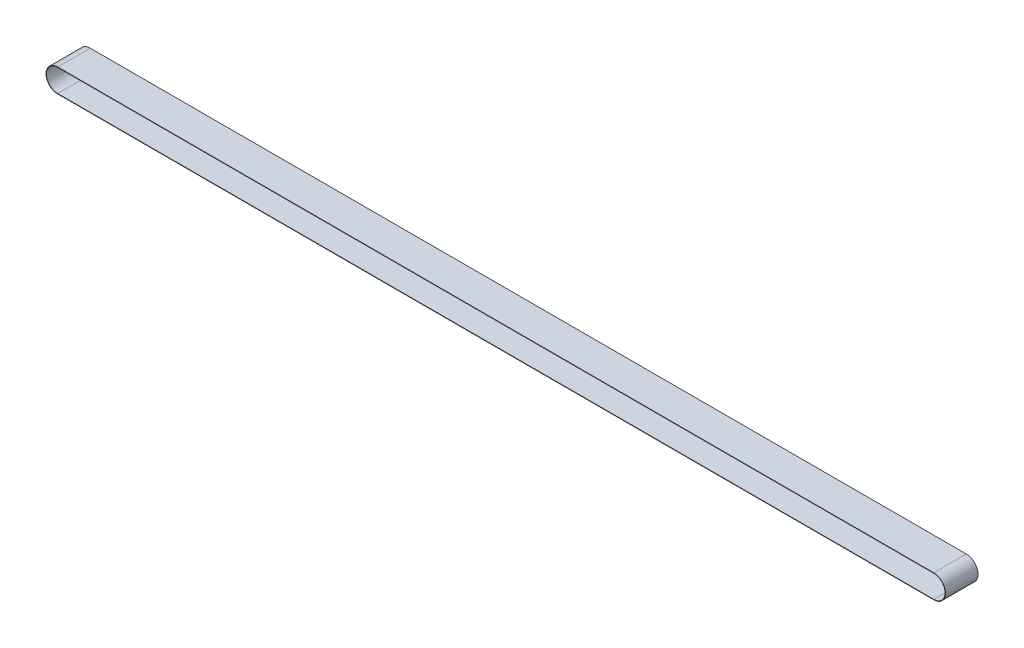
ISO-10303-21;
HEADER;
FILE_DESCRIPTION(('STEP AP214'),'2;1');
FILE_NAME('part.step','',(''),(''),'','','');
FILE_SCHEMA(('AUTOMOTIVE_DESIGN { 1 0 10303 214 1 1 1 1 }'));
ENDSEC;
DATA;
#1=APPLICATION_CONTEXT('core data for automotive mechanical design processes');
#2=APPLICATION_PROTOCOL_DEFINITION('international standard','automotive_design',2000,#1);
#3=PRODUCT_CONTEXT('',#1,'mechanical');
#4=PRODUCT('Part','Part','',(#3));
#5=PRODUCT_RELATED_PRODUCT_CATEGORY('part','',(#4));
#6=PRODUCT_DEFINITION_FORMATION('','',#4);
#7=PRODUCT_DEFINITION_CONTEXT('part definition',#1,'design');
#8=PRODUCT_DEFINITION('design','',#6,#7);
#9=PRODUCT_DEFINITION_SHAPE('','',#8);
#10=(LENGTH_UNIT() NAMED_UNIT(*) SI_UNIT(.MILLI.,.METRE.));
#11=(NAMED_UNIT(*) PLANE_ANGLE_UNIT() SI_UNIT($,.RADIAN.));
#12=(NAMED_UNIT(*) SI_UNIT($,.STERADIAN.) SOLID_ANGLE_UNIT());
#13=UNCERTAINTY_MEASURE_WITH_UNIT(LENGTH_MEASURE(1.E-05),#10,'distance_accuracy_value','');
#14=(GEOMETRIC_REPRESENTATION_CONTEXT(3) GLOBAL_UNCERTAINTY_ASSIGNED_CONTEXT((#13)) GLOBAL_UNIT_ASSIGNED_CONTEXT((#10,
#11,#12)) REPRESENTATION_CONTEXT('',''));
#15=CARTESIAN_POINT('',(0.,0.,0.));
#16=DIRECTION('',(0.,0.,1.));
#17=DIRECTION('',(1.,0.,0.));
#18=AXIS2_PLACEMENT_3D('',#15,#16,#17);
#19=CARTESIAN_POINT('',(-1010.,0.,37.5));
#20=DIRECTION('',(0.,0.,1.));
#21=DIRECTION('',(1.,0.,0.));
#22=AXIS2_PLACEMENT_3D('',#19,#20,#21);
#23=PLANE('',#22);
#24=CARTESIAN_POINT('',(-1010.,0.,37.5));
#25=DIRECTION('',(0.,0.,1.));
#26=DIRECTION('',(1.,0.,0.));
#27=AXIS2_PLACEMENT_3D('',#24,#25,#26);
#28=CIRCLE('',#27,27.0000000000004);
#29=CARTESIAN_POINT('',(-1010.,27.0000000000004,37.5));
#30=VERTEX_POINT('',#29);
#31=CARTESIAN_POINT('',(-1010.,-27.0000000000004,37.5));
#32=VERTEX_POINT('',#31);
#33=EDGE_CURVE('E159',#30,#32,#28,.T.);
#34=ORIENTED_EDGE('',*,*,#33,.T.);
#35=DIRECTION('',(1.,0.,0.));
#36=VECTOR('',#35,1.);
#37=CARTESIAN_POINT('',(-1010.,-27.0000000000004,37.5));
#38=LINE('',#37,#36);
#39=CARTESIAN_POINT('',(1010.,-27.,37.5));
#40=VERTEX_POINT('',#39);
#41=EDGE_CURVE('E162',#32,#40,#38,.T.);
#42=ORIENTED_EDGE('',*,*,#41,.T.);
#43=CARTESIAN_POINT('',(1010.,0.,37.5));
#44=DIRECTION('',(0.,0.,1.));
#45=DIRECTION('',(1.,0.,0.));
#46=AXIS2_PLACEMENT_3D('',#43,#44,#45);
#47=CIRCLE('',#46,27.0000000000004);
#48=CARTESIAN_POINT('',(1010.,27.0000000000004,37.5));
#49=VERTEX_POINT('',#48);
#50=EDGE_CURVE('E165',#40,#49,#47,.T.);
#51=ORIENTED_EDGE('',*,*,#50,.T.);
#52=DIRECTION('',(-1.,0.,0.));
#53=VECTOR('',#52,1.);
#54=CARTESIAN_POINT('',(-1010.,27.0000000000004,37.5));
#55=LINE('',#54,#53);
#56=EDGE_CURVE('E167',#49,#30,#55,.T.);
#57=ORIENTED_EDGE('',*,*,#56,.T.);
#58=EDGE_LOOP('',(#34,#42,#51,#57));
#59=FACE_BOUND('',#58,.T.);
#60=DIRECTION('',(1.,0.,0.));
#61=VECTOR('',#60,1.);
#62=CARTESIAN_POINT('',(-1010.,-26.0000000000004,37.5));
#63=LINE('',#62,#61);
#64=CARTESIAN_POINT('',(-1010.,-26.0000000000004,37.5));
#65=VERTEX_POINT('',#64);
#66=CARTESIAN_POINT('',(1010.,-26.0000000000004,37.5));
#67=VERTEX_POINT('',#66);
#68=EDGE_CURVE('E131',#65,#67,#63,.T.);
#69=ORIENTED_EDGE('',*,*,#68,.F.);
#70=CARTESIAN_POINT('',(-1010.,0.,37.5));
#71=DIRECTION('',(0.,0.,1.));
#72=DIRECTION('',(1.,0.,0.));
#73=AXIS2_PLACEMENT_3D('',#70,#71,#72);
#74=CIRCLE('',#73,26.0000000000004);
#75=CARTESIAN_POINT('',(-1010.,26.0000000000004,37.5));
#76=VERTEX_POINT('',#75);
#77=EDGE_CURVE('E123',#76,#65,#74,.T.);
#78=ORIENTED_EDGE('',*,*,#77,.F.);
#79=DIRECTION('',(-1.,0.,0.));
#80=VECTOR('',#79,1.);
#81=CARTESIAN_POINT('',(-1010.,26.0000000000004,37.5));
#82=LINE('',#81,#80);
#83=CARTESIAN_POINT('',(1010.,26.0000000000007,37.5));
#84=VERTEX_POINT('',#83);
#85=EDGE_CURVE('E145',#84,#76,#82,.T.);
#86=ORIENTED_EDGE('',*,*,#85,.F.);
#87=CARTESIAN_POINT('',(1010.,0.,37.5));
#88=DIRECTION('',(0.,0.,1.));
#89=DIRECTION('',(1.,0.,0.));
#90=AXIS2_PLACEMENT_3D('',#87,#88,#89);
#91=CIRCLE('',#90,26.0000000000004);
#92=EDGE_CURVE('E143',#67,#84,#91,.T.);
#93=ORIENTED_EDGE('',*,*,#92,.F.);
#94=EDGE_LOOP('',(#69,#78,#86,#93));
#95=FACE_BOUND('',#94,.T.);
#96=ADVANCED_FACE('F58',(#59,#95),#23,.T.);
#97=CARTESIAN_POINT('',(-1010.,0.,-37.5));
#98=DIRECTION('',(0.,0.,1.));
#99=DIRECTION('',(1.,0.,0.));
#100=AXIS2_PLACEMENT_3D('',#97,#98,#99);
#101=PLANE('',#100);
#102=CARTESIAN_POINT('',(-1010.,0.,-37.5));
#103=DIRECTION('',(0.,0.,1.));
#104=DIRECTION('',(1.,0.,0.));
#105=AXIS2_PLACEMENT_3D('',#102,#103,#104);
#106=CIRCLE('',#105,27.0000000000004);
#107=CARTESIAN_POINT('',(-1010.,27.0000000000004,-37.5));
#108=VERTEX_POINT('',#107);
#109=CARTESIAN_POINT('',(-1010.,-27.0000000000004,-37.5));
#110=VERTEX_POINT('',#109);
#111=EDGE_CURVE('E139',#108,#110,#106,.T.);
#112=ORIENTED_EDGE('',*,*,#111,.F.);
#113=DIRECTION('',(-1.,0.,0.));
#114=VECTOR('',#113,1.);
#115=CARTESIAN_POINT('',(-1010.,27.0000000000004,-37.5));
#116=LINE('',#115,#114);
#117=CARTESIAN_POINT('',(1010.,27.0000000000004,-37.5));
#118=VERTEX_POINT('',#117);
#119=EDGE_CURVE('E163',#118,#108,#116,.T.);
#120=ORIENTED_EDGE('',*,*,#119,.F.);
#121=CARTESIAN_POINT('',(1010.,0.,-37.5));
#122=DIRECTION('',(0.,0.,1.));
#123=DIRECTION('',(1.,0.,0.));
#124=AXIS2_PLACEMENT_3D('',#121,#122,#123);
#125=CIRCLE('',#124,27.0000000000004);
#126=CARTESIAN_POINT('',(1010.,-27.,-37.5));
#127=VERTEX_POINT('',#126);
#128=EDGE_CURVE('E174',#127,#118,#125,.T.);
#129=ORIENTED_EDGE('',*,*,#128,.F.);
#130=DIRECTION('',(1.,0.,0.));
#131=VECTOR('',#130,1.);
#132=CARTESIAN_POINT('',(-1010.,-27.0000000000004,-37.5));
#133=LINE('',#132,#131);
#134=EDGE_CURVE('E172',#110,#127,#133,.T.);
#135=ORIENTED_EDGE('',*,*,#134,.F.);
#136=EDGE_LOOP('',(#112,#120,#129,#135));
#137=FACE_BOUND('',#136,.T.);
#138=CARTESIAN_POINT('',(-1010.,0.,-37.5));
#139=DIRECTION('',(0.,0.,1.));
#140=DIRECTION('',(1.,0.,0.));
#141=AXIS2_PLACEMENT_3D('',#138,#139,#140);
#142=CIRCLE('',#141,26.0000000000004);
#143=CARTESIAN_POINT('',(-1010.,26.0000000000004,-37.5));
#144=VERTEX_POINT('',#143);
#145=CARTESIAN_POINT('',(-1010.,-26.0000000000004,-37.5));
#146=VERTEX_POINT('',#145);
#147=EDGE_CURVE('E81',#144,#146,#142,.T.);
#148=ORIENTED_EDGE('',*,*,#147,.T.);
#149=DIRECTION('',(1.,0.,0.));
#150=VECTOR('',#149,1.);
#151=CARTESIAN_POINT('',(-1010.,-26.0000000000004,-37.5));
#152=LINE('',#151,#150);
#153=CARTESIAN_POINT('',(1010.,-26.0000000000004,-37.5));
#154=VERTEX_POINT('',#153);
#155=EDGE_CURVE('E138',#146,#154,#152,.T.);
#156=ORIENTED_EDGE('',*,*,#155,.T.);
#157=CARTESIAN_POINT('',(1010.,0.,-37.5));
#158=DIRECTION('',(0.,0.,1.));
#159=DIRECTION('',(1.,0.,0.));
#160=AXIS2_PLACEMENT_3D('',#157,#158,#159);
#161=CIRCLE('',#160,26.0000000000004);
#162=CARTESIAN_POINT('',(1010.,26.0000000000007,-37.5));
#163=VERTEX_POINT('',#162);
#164=EDGE_CURVE('E151',#154,#163,#161,.T.);
#165=ORIENTED_EDGE('',*,*,#164,.T.);
#166=DIRECTION('',(-1.,0.,0.));
#167=VECTOR('',#166,1.);
#168=CARTESIAN_POINT('',(-1010.,26.0000000000004,-37.5));
#169=LINE('',#168,#167);
#170=EDGE_CURVE('E132',#163,#144,#169,.T.);
#171=ORIENTED_EDGE('',*,*,#170,.T.);
#172=EDGE_LOOP('',(#148,#156,#165,#171));
#173=FACE_BOUND('',#172,.T.);
#174=ADVANCED_FACE('F192',(#137,#173),#101,.F.);
#175=CARTESIAN_POINT('',(-1010.,0.,37.5));
#176=DIRECTION('',(0.,0.,-1.));
#177=DIRECTION('',(-1.,0.,0.));
#178=AXIS2_PLACEMENT_3D('',#175,#176,#177);
#179=CYLINDRICAL_SURFACE('',#178,27.0000000000004);
#180=ORIENTED_EDGE('',*,*,#111,.T.);
#181=DIRECTION('',(0.,0.,-1.));
#182=VECTOR('',#181,1.);
#183=CARTESIAN_POINT('',(-1010.,-27.0000000000004,37.5));
#184=LINE('',#183,#182);
#185=EDGE_CURVE('E12',#32,#110,#184,.T.);
#186=ORIENTED_EDGE('',*,*,#185,.F.);
#187=ORIENTED_EDGE('',*,*,#33,.F.);
#188=DIRECTION('',(0.,0.,-1.));
#189=VECTOR('',#188,1.);
#190=CARTESIAN_POINT('',(-1010.,27.0000000000004,37.5));
#191=LINE('',#190,#189);
#192=EDGE_CURVE('E169',#30,#108,#191,.T.);
#193=ORIENTED_EDGE('',*,*,#192,.T.);
#194=EDGE_LOOP('',(#180,#186,#187,#193));
#195=FACE_BOUND('',#194,.T.);
#196=ADVANCED_FACE('F60',(#195),#179,.T.);
#197=CARTESIAN_POINT('',(-1010.,-27.0000000000004,37.5));
#198=DIRECTION('',(0.,1.,0.));
#199=DIRECTION('',(-1.,0.,0.));
#200=AXIS2_PLACEMENT_3D('',#197,#198,#199);
#201=PLANE('',#200);
#202=ORIENTED_EDGE('',*,*,#134,.T.);
#203=DIRECTION('',(0.,0.,-1.));
#204=VECTOR('',#203,1.);
#205=CARTESIAN_POINT('',(1010.,-27.,37.5));
#206=LINE('',#205,#204);
#207=EDGE_CURVE('E66',#40,#127,#206,.T.);
#208=ORIENTED_EDGE('',*,*,#207,.F.);
#209=ORIENTED_EDGE('',*,*,#41,.F.);
#210=ORIENTED_EDGE('',*,*,#185,.T.);
#211=EDGE_LOOP('',(#202,#208,#209,#210));
#212=FACE_BOUND('',#211,.T.);
#213=ADVANCED_FACE('F202',(#212),#201,.F.);
#214=CARTESIAN_POINT('',(1010.,0.,37.5));
#215=DIRECTION('',(0.,0.,-1.));
#216=DIRECTION('',(-1.,0.,0.));
#217=AXIS2_PLACEMENT_3D('',#214,#215,#216);
#218=CYLINDRICAL_SURFACE('',#217,27.0000000000004);
#219=ORIENTED_EDGE('',*,*,#128,.T.);
#220=DIRECTION('',(0.,0.,-1.));
#221=VECTOR('',#220,1.);
#222=CARTESIAN_POINT('',(1010.,27.0000000000004,37.5));
#223=LINE('',#222,#221);
#224=EDGE_CURVE('E179',#49,#118,#223,.T.);
#225=ORIENTED_EDGE('',*,*,#224,.F.);
#226=ORIENTED_EDGE('',*,*,#50,.F.);
#227=ORIENTED_EDGE('',*,*,#207,.T.);
#228=EDGE_LOOP('',(#219,#225,#226,#227));
#229=FACE_BOUND('',#228,.T.);
#230=ADVANCED_FACE('F186',(#229),#218,.T.);
#231=CARTESIAN_POINT('',(-1010.,27.0000000000004,37.5));
#232=DIRECTION('',(0.,-1.,0.));
#233=DIRECTION('',(1.,0.,0.));
#234=AXIS2_PLACEMENT_3D('',#231,#232,#233);
#235=PLANE('',#234);
#236=ORIENTED_EDGE('',*,*,#119,.T.);
#237=ORIENTED_EDGE('',*,*,#192,.F.);
#238=ORIENTED_EDGE('',*,*,#56,.F.);
#239=ORIENTED_EDGE('',*,*,#224,.T.);
#240=EDGE_LOOP('',(#236,#237,#238,#239));
#241=FACE_BOUND('',#240,.T.);
#242=ADVANCED_FACE('F196',(#241),#235,.F.);
#243=CARTESIAN_POINT('',(-1010.,0.,37.5));
#244=DIRECTION('',(0.,0.,-1.));
#245=DIRECTION('',(-1.,0.,0.));
#246=AXIS2_PLACEMENT_3D('',#243,#244,#245);
#247=CYLINDRICAL_SURFACE('',#246,26.0000000000004);
#248=ORIENTED_EDGE('',*,*,#147,.F.);
#249=DIRECTION('',(0.,0.,-1.));
#250=VECTOR('',#249,1.);
#251=CARTESIAN_POINT('',(-1010.,26.0000000000004,37.5));
#252=LINE('',#251,#250);
#253=EDGE_CURVE('E127',#76,#144,#252,.T.);
#254=ORIENTED_EDGE('',*,*,#253,.F.);
#255=ORIENTED_EDGE('',*,*,#77,.T.);
#256=DIRECTION('',(0.,0.,-1.));
#257=VECTOR('',#256,1.);
#258=CARTESIAN_POINT('',(-1010.,-26.0000000000004,37.5));
#259=LINE('',#258,#257);
#260=EDGE_CURVE('E126',#65,#146,#259,.T.);
#261=ORIENTED_EDGE('',*,*,#260,.T.);
#262=EDGE_LOOP('',(#248,#254,#255,#261));
#263=FACE_BOUND('',#262,.T.);
#264=ADVANCED_FACE('F125',(#263),#247,.F.);
#265=CARTESIAN_POINT('',(-1010.,-26.0000000000004,37.5));
#266=DIRECTION('',(0.,1.,0.));
#267=DIRECTION('',(-1.,0.,0.));
#268=AXIS2_PLACEMENT_3D('',#265,#266,#267);
#269=PLANE('',#268);
#270=ORIENTED_EDGE('',*,*,#155,.F.);
#271=ORIENTED_EDGE('',*,*,#260,.F.);
#272=ORIENTED_EDGE('',*,*,#68,.T.);
#273=DIRECTION('',(0.,0.,-1.));
#274=VECTOR('',#273,1.);
#275=CARTESIAN_POINT('',(1010.,-26.0000000000004,37.5));
#276=LINE('',#275,#274);
#277=EDGE_CURVE('E140',#67,#154,#276,.T.);
#278=ORIENTED_EDGE('',*,*,#277,.T.);
#279=EDGE_LOOP('',(#270,#271,#272,#278));
#280=FACE_BOUND('',#279,.T.);
#281=ADVANCED_FACE('F135',(#280),#269,.T.);
#282=CARTESIAN_POINT('',(1010.,0.,37.5));
#283=DIRECTION('',(0.,0.,-1.));
#284=DIRECTION('',(-1.,0.,0.));
#285=AXIS2_PLACEMENT_3D('',#282,#283,#284);
#286=CYLINDRICAL_SURFACE('',#285,26.0000000000004);
#287=ORIENTED_EDGE('',*,*,#164,.F.);
#288=ORIENTED_EDGE('',*,*,#277,.F.);
#289=ORIENTED_EDGE('',*,*,#92,.T.);
#290=DIRECTION('',(0.,0.,-1.));
#291=VECTOR('',#290,1.);
#292=CARTESIAN_POINT('',(1010.,26.0000000000007,37.5));
#293=LINE('',#292,#291);
#294=EDGE_CURVE('E73',#84,#163,#293,.T.);
#295=ORIENTED_EDGE('',*,*,#294,.T.);
#296=EDGE_LOOP('',(#287,#288,#289,#295));
#297=FACE_BOUND('',#296,.T.);
#298=ADVANCED_FACE('F225',(#297),#286,.F.);
#299=CARTESIAN_POINT('',(-1010.,26.0000000000004,37.5));
#300=DIRECTION('',(0.,-1.,0.));
#301=DIRECTION('',(1.,0.,0.));
#302=AXIS2_PLACEMENT_3D('',#299,#300,#301);
#303=PLANE('',#302);
#304=ORIENTED_EDGE('',*,*,#170,.F.);
#305=ORIENTED_EDGE('',*,*,#294,.F.);
#306=ORIENTED_EDGE('',*,*,#85,.T.);
#307=ORIENTED_EDGE('',*,*,#253,.T.);
#308=EDGE_LOOP('',(#304,#305,#306,#307));
#309=FACE_BOUND('',#308,.T.);
#310=ADVANCED_FACE('F229',(#309),#303,.T.);
#311=CLOSED_SHELL('',(#96,#174,#196,#213,#230,#242,#264,#281,#298,#310));
#312=MANIFOLD_SOLID_BREP('B2',#311);
#313=ADVANCED_BREP_SHAPE_REPRESENTATION('',(#18,#312),#14);
#314=SHAPE_DEFINITION_REPRESENTATION(#9,#313);
ENDSEC;
END-ISO-10303-21;
